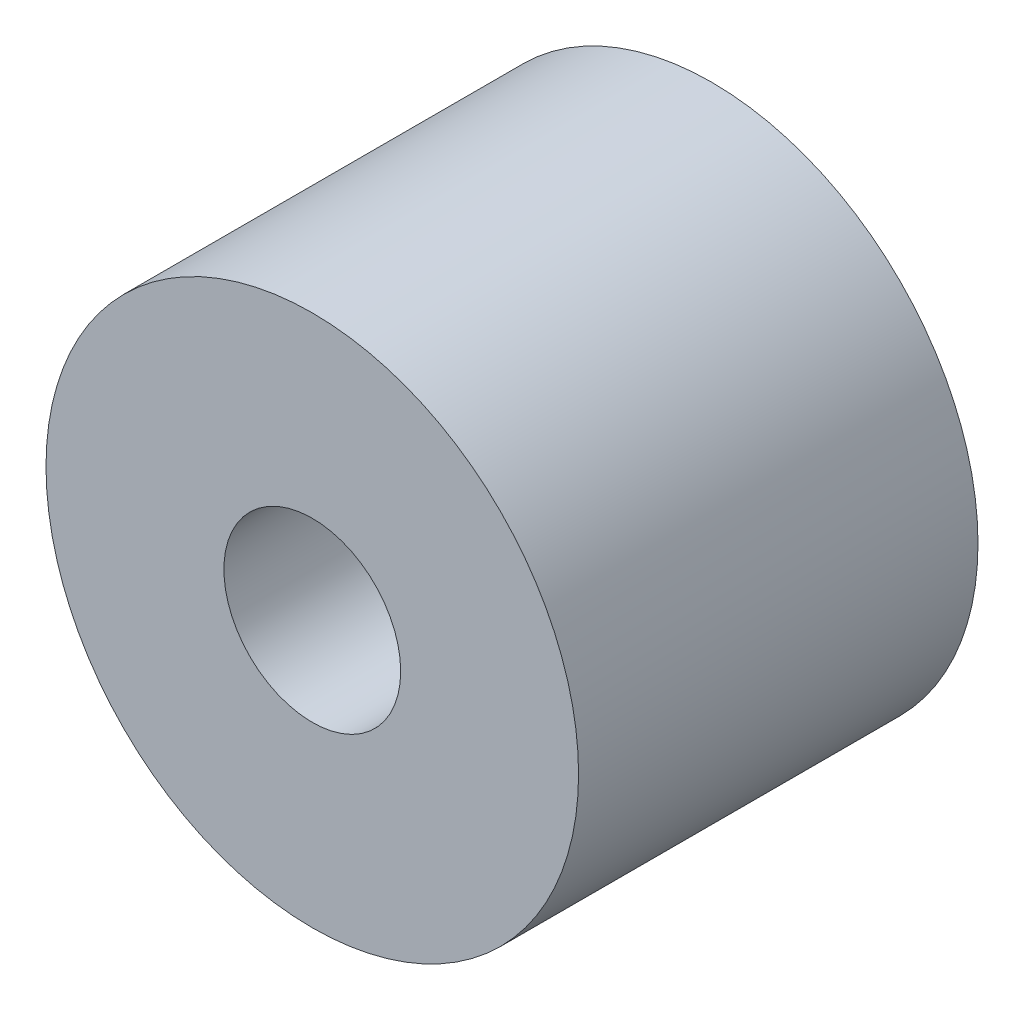
ISO-10303-21;
HEADER;
FILE_DESCRIPTION(('STEP AP214'),'2;1');
FILE_NAME('part.step','',(''),(''),'','','');
FILE_SCHEMA(('AUTOMOTIVE_DESIGN { 1 0 10303 214 1 1 1 1 }'));
ENDSEC;
DATA;
#1=APPLICATION_CONTEXT('core data for automotive mechanical design processes');
#2=APPLICATION_PROTOCOL_DEFINITION('international standard','automotive_design',2000,#1);
#3=PRODUCT_CONTEXT('',#1,'mechanical');
#4=PRODUCT('Part','Part','',(#3));
#5=PRODUCT_RELATED_PRODUCT_CATEGORY('part','',(#4));
#6=PRODUCT_DEFINITION_FORMATION('','',#4);
#7=PRODUCT_DEFINITION_CONTEXT('part definition',#1,'design');
#8=PRODUCT_DEFINITION('design','',#6,#7);
#9=PRODUCT_DEFINITION_SHAPE('','',#8);
#10=(LENGTH_UNIT() NAMED_UNIT(*) SI_UNIT(.MILLI.,.METRE.));
#11=(NAMED_UNIT(*) PLANE_ANGLE_UNIT() SI_UNIT($,.RADIAN.));
#12=(NAMED_UNIT(*) SI_UNIT($,.STERADIAN.) SOLID_ANGLE_UNIT());
#13=UNCERTAINTY_MEASURE_WITH_UNIT(LENGTH_MEASURE(1.E-05),#10,'distance_accuracy_value','');
#14=(GEOMETRIC_REPRESENTATION_CONTEXT(3) GLOBAL_UNCERTAINTY_ASSIGNED_CONTEXT((#13)) GLOBAL_UNIT_ASSIGNED_CONTEXT((#10,
#11,#12)) REPRESENTATION_CONTEXT('',''));
#15=CARTESIAN_POINT('',(0.,0.,0.));
#16=DIRECTION('',(0.,0.,1.));
#17=DIRECTION('',(1.,0.,0.));
#18=AXIS2_PLACEMENT_3D('',#15,#16,#17);
#19=CARTESIAN_POINT('',(0.,0.,4.7625));
#20=DIRECTION('',(0.,0.,1.));
#21=DIRECTION('',(1.,0.,0.));
#22=AXIS2_PLACEMENT_3D('',#19,#20,#21);
#23=PLANE('',#22);
#24=CARTESIAN_POINT('',(0.,0.,4.7625));
#25=DIRECTION('',(0.,0.,1.));
#26=DIRECTION('',(1.,0.,0.));
#27=AXIS2_PLACEMENT_3D('',#24,#25,#26);
#28=CIRCLE('',#27,6.35);
#29=CARTESIAN_POINT('',(6.35,0.,4.7625));
#30=VERTEX_POINT('',#29);
#31=EDGE_CURVE('E10',#30,#30,#28,.T.);
#32=ORIENTED_EDGE('',*,*,#31,.T.);
#33=EDGE_LOOP('',(#32));
#34=FACE_BOUND('',#33,.T.);
#35=CARTESIAN_POINT('',(0.,0.,4.7625));
#36=DIRECTION('',(0.,0.,1.));
#37=DIRECTION('',(1.,0.,0.));
#38=AXIS2_PLACEMENT_3D('',#35,#36,#37);
#39=CIRCLE('',#38,2.1082);
#40=CARTESIAN_POINT('',(2.1082,0.,4.7625));
#41=VERTEX_POINT('',#40);
#42=EDGE_CURVE('E43',#41,#41,#39,.T.);
#43=ORIENTED_EDGE('',*,*,#42,.F.);
#44=EDGE_LOOP('',(#43));
#45=FACE_BOUND('',#44,.T.);
#46=ADVANCED_FACE('F32',(#34,#45),#23,.T.);
#47=CARTESIAN_POINT('',(0.,0.,-4.7625));
#48=DIRECTION('',(0.,0.,1.));
#49=DIRECTION('',(1.,0.,0.));
#50=AXIS2_PLACEMENT_3D('',#47,#48,#49);
#51=PLANE('',#50);
#52=CARTESIAN_POINT('',(0.,0.,-4.7625));
#53=DIRECTION('',(0.,0.,1.));
#54=DIRECTION('',(1.,0.,0.));
#55=AXIS2_PLACEMENT_3D('',#52,#53,#54);
#56=CIRCLE('',#55,6.35);
#57=CARTESIAN_POINT('',(6.35,0.,-4.7625));
#58=VERTEX_POINT('',#57);
#59=EDGE_CURVE('E36',#58,#58,#56,.T.);
#60=ORIENTED_EDGE('',*,*,#59,.F.);
#61=EDGE_LOOP('',(#60));
#62=FACE_BOUND('',#61,.T.);
#63=CARTESIAN_POINT('',(0.,0.,-4.7625));
#64=DIRECTION('',(0.,0.,1.));
#65=DIRECTION('',(1.,0.,0.));
#66=AXIS2_PLACEMENT_3D('',#63,#64,#65);
#67=CIRCLE('',#66,2.1082);
#68=CARTESIAN_POINT('',(2.1082,0.,-4.7625));
#69=VERTEX_POINT('',#68);
#70=EDGE_CURVE('E45',#69,#69,#67,.T.);
#71=ORIENTED_EDGE('',*,*,#70,.T.);
#72=EDGE_LOOP('',(#71));
#73=FACE_BOUND('',#72,.T.);
#74=ADVANCED_FACE('F55',(#62,#73),#51,.F.);
#75=CARTESIAN_POINT('',(0.,0.,4.7625));
#76=DIRECTION('',(0.,0.,-1.));
#77=DIRECTION('',(-1.,0.,0.));
#78=AXIS2_PLACEMENT_3D('',#75,#76,#77);
#79=CYLINDRICAL_SURFACE('',#78,6.35);
#80=ORIENTED_EDGE('',*,*,#31,.F.);
#81=EDGE_LOOP('',(#80));
#82=FACE_BOUND('',#81,.T.);
#83=ORIENTED_EDGE('',*,*,#59,.T.);
#84=EDGE_LOOP('',(#83));
#85=FACE_BOUND('',#84,.T.);
#86=ADVANCED_FACE('F34',(#82,#85),#79,.T.);
#87=CARTESIAN_POINT('',(0.,0.,4.7625));
#88=DIRECTION('',(0.,0.,-1.));
#89=DIRECTION('',(-1.,0.,0.));
#90=AXIS2_PLACEMENT_3D('',#87,#88,#89);
#91=CYLINDRICAL_SURFACE('',#90,2.1082);
#92=ORIENTED_EDGE('',*,*,#42,.T.);
#93=EDGE_LOOP('',(#92));
#94=FACE_BOUND('',#93,.T.);
#95=ORIENTED_EDGE('',*,*,#70,.F.);
#96=EDGE_LOOP('',(#95));
#97=FACE_BOUND('',#96,.T.);
#98=ADVANCED_FACE('F51',(#94,#97),#91,.F.);
#99=CLOSED_SHELL('',(#46,#74,#86,#98));
#100=MANIFOLD_SOLID_BREP('B2',#99);
#101=ADVANCED_BREP_SHAPE_REPRESENTATION('',(#18,#100),#14);
#102=SHAPE_DEFINITION_REPRESENTATION(#9,#101);
ENDSEC;
END-ISO-10303-21;
